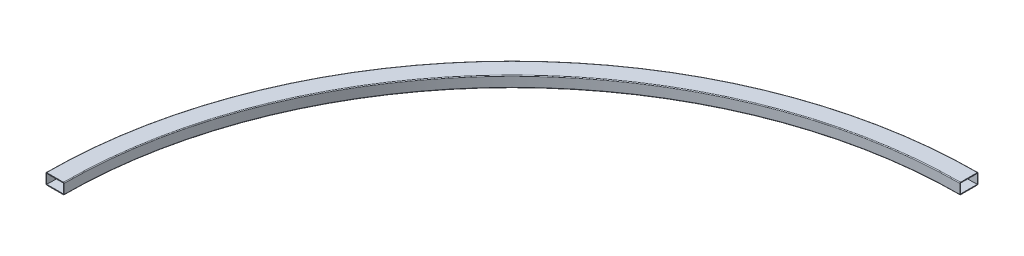
ISO-10303-21;
HEADER;
FILE_DESCRIPTION(('STEP AP214'),'2;1');
FILE_NAME('part.step','',(''),(''),'','','');
FILE_SCHEMA(('AUTOMOTIVE_DESIGN { 1 0 10303 214 1 1 1 1 }'));
ENDSEC;
DATA;
#1=APPLICATION_CONTEXT('core data for automotive mechanical design processes');
#2=APPLICATION_PROTOCOL_DEFINITION('international standard','automotive_design',2000,#1);
#3=PRODUCT_CONTEXT('',#1,'mechanical');
#4=PRODUCT('Part','Part','',(#3));
#5=PRODUCT_RELATED_PRODUCT_CATEGORY('part','',(#4));
#6=PRODUCT_DEFINITION_FORMATION('','',#4);
#7=PRODUCT_DEFINITION_CONTEXT('part definition',#1,'design');
#8=PRODUCT_DEFINITION('design','',#6,#7);
#9=PRODUCT_DEFINITION_SHAPE('','',#8);
#10=(LENGTH_UNIT() NAMED_UNIT(*) SI_UNIT(.MILLI.,.METRE.));
#11=(NAMED_UNIT(*) PLANE_ANGLE_UNIT() SI_UNIT($,.RADIAN.));
#12=(NAMED_UNIT(*) SI_UNIT($,.STERADIAN.) SOLID_ANGLE_UNIT());
#13=UNCERTAINTY_MEASURE_WITH_UNIT(LENGTH_MEASURE(1.E-05),#10,'distance_accuracy_value','');
#14=(GEOMETRIC_REPRESENTATION_CONTEXT(3) GLOBAL_UNCERTAINTY_ASSIGNED_CONTEXT((#13)) GLOBAL_UNIT_ASSIGNED_CONTEXT((#10,
#11,#12)) REPRESENTATION_CONTEXT('',''));
#15=CARTESIAN_POINT('',(0.,0.,0.));
#16=DIRECTION('',(0.,0.,1.));
#17=DIRECTION('',(1.,0.,0.));
#18=AXIS2_PLACEMENT_3D('',#15,#16,#17);
#19=CARTESIAN_POINT('',(0.,-6.5,0.));
#20=DIRECTION('',(0.,1.,0.));
#21=DIRECTION('',(0.,0.,1.));
#22=AXIS2_PLACEMENT_3D('',#19,#20,#21);
#23=TOROIDAL_SURFACE('',#22,642.,1.00000000000011);
#24=CARTESIAN_POINT('',(0.,-7.5,0.));
#25=DIRECTION('',(0.,1.,0.));
#26=DIRECTION('',(0.,0.,1.));
#27=AXIS2_PLACEMENT_3D('',#24,#25,#26);
#28=CIRCLE('',#27,642.);
#29=CARTESIAN_POINT('',(2.24153101953729E-12,-7.5,-642.));
#30=VERTEX_POINT('',#29);
#31=CARTESIAN_POINT('',(-642.,-7.5,0.));
#32=VERTEX_POINT('',#31);
#33=EDGE_CURVE('E11',#30,#32,#28,.T.);
#34=ORIENTED_EDGE('',*,*,#33,.T.);
#35=CARTESIAN_POINT('',(-642.,-6.5,0.));
#36=DIRECTION('',(0.,0.,1.));
#37=DIRECTION('',(-1.,0.,0.));
#38=AXIS2_PLACEMENT_3D('',#35,#36,#37);
#39=CIRCLE('',#38,1.00000000000011);
#40=CARTESIAN_POINT('',(-643.,-6.5,0.));
#41=VERTEX_POINT('',#40);
#42=EDGE_CURVE('E111',#41,#32,#39,.T.);
#43=ORIENTED_EDGE('',*,*,#42,.F.);
#44=CARTESIAN_POINT('',(0.,-6.5,0.));
#45=DIRECTION('',(0.,1.,0.));
#46=DIRECTION('',(0.,0.,1.));
#47=AXIS2_PLACEMENT_3D('',#44,#45,#46);
#48=CIRCLE('',#47,643.);
#49=CARTESIAN_POINT('',(2.24502250087614E-12,-6.5,-643.));
#50=VERTEX_POINT('',#49);
#51=EDGE_CURVE('E188',#50,#41,#48,.T.);
#52=ORIENTED_EDGE('',*,*,#51,.F.);
#53=CARTESIAN_POINT('',(2.24153101953729E-12,-6.5,-642.));
#54=DIRECTION('',(-1.,0.,0.));
#55=DIRECTION('',(0.,0.,-1.));
#56=AXIS2_PLACEMENT_3D('',#53,#54,#55);
#57=CIRCLE('',#56,1.00000000000011);
#58=EDGE_CURVE('E164',#50,#30,#57,.T.);
#59=ORIENTED_EDGE('',*,*,#58,.T.);
#60=EDGE_LOOP('',(#34,#43,#52,#59));
#61=FACE_BOUND('',#60,.T.);
#62=ADVANCED_FACE('F16',(#61),#23,.T.);
#63=CARTESIAN_POINT('',(2.24153101953729E-12,-7.5,-642.));
#64=DIRECTION('',(0.,-1.,0.));
#65=DIRECTION('',(0.,0.,-1.));
#66=AXIS2_PLACEMENT_3D('',#63,#64,#65);
#67=PLANE('',#66);
#68=CARTESIAN_POINT('',(0.,-7.5,0.));
#69=DIRECTION('',(0.,1.,0.));
#70=DIRECTION('',(0.,0.,1.));
#71=AXIS2_PLACEMENT_3D('',#68,#69,#70);
#72=CIRCLE('',#71,619.);
#73=CARTESIAN_POINT('',(2.1612269487439E-12,-7.5,-619.));
#74=VERTEX_POINT('',#73);
#75=CARTESIAN_POINT('',(-619.,-7.5,0.));
#76=VERTEX_POINT('',#75);
#77=EDGE_CURVE('E24',#74,#76,#72,.T.);
#78=ORIENTED_EDGE('',*,*,#77,.T.);
#79=DIRECTION('',(1.,0.,0.));
#80=VECTOR('',#79,1.);
#81=CARTESIAN_POINT('',(-642.,-7.5,0.));
#82=LINE('',#81,#80);
#83=EDGE_CURVE('E143',#32,#76,#82,.T.);
#84=ORIENTED_EDGE('',*,*,#83,.F.);
#85=ORIENTED_EDGE('',*,*,#33,.F.);
#86=DIRECTION('',(0.,0.,1.));
#87=VECTOR('',#86,1.);
#88=CARTESIAN_POINT('',(2.24153101953729E-12,-7.5,-642.));
#89=LINE('',#88,#87);
#90=EDGE_CURVE('E167',#30,#74,#89,.T.);
#91=ORIENTED_EDGE('',*,*,#90,.T.);
#92=EDGE_LOOP('',(#78,#84,#85,#91));
#93=FACE_BOUND('',#92,.T.);
#94=ADVANCED_FACE('F18',(#93),#67,.T.);
#95=CARTESIAN_POINT('',(0.,-6.5,0.));
#96=DIRECTION('',(0.,1.,0.));
#97=DIRECTION('',(0.,0.,1.));
#98=AXIS2_PLACEMENT_3D('',#95,#96,#97);
#99=TOROIDAL_SURFACE('',#98,619.,1.);
#100=CARTESIAN_POINT('',(0.,-6.5,0.));
#101=DIRECTION('',(0.,1.,0.));
#102=DIRECTION('',(0.,0.,1.));
#103=AXIS2_PLACEMENT_3D('',#100,#101,#102);
#104=CIRCLE('',#103,618.);
#105=CARTESIAN_POINT('',(2.15773546740506E-12,-6.5,-618.));
#106=VERTEX_POINT('',#105);
#107=CARTESIAN_POINT('',(-618.,-6.5,0.));
#108=VERTEX_POINT('',#107);
#109=EDGE_CURVE('E198',#106,#108,#104,.T.);
#110=ORIENTED_EDGE('',*,*,#109,.T.);
#111=CARTESIAN_POINT('',(-619.,-6.5,0.));
#112=DIRECTION('',(0.,0.,1.));
#113=DIRECTION('',(1.,0.,0.));
#114=AXIS2_PLACEMENT_3D('',#111,#112,#113);
#115=CIRCLE('',#114,1.);
#116=EDGE_CURVE('E146',#76,#108,#115,.T.);
#117=ORIENTED_EDGE('',*,*,#116,.F.);
#118=ORIENTED_EDGE('',*,*,#77,.F.);
#119=CARTESIAN_POINT('',(2.1612269487439E-12,-6.5,-619.));
#120=DIRECTION('',(-1.,0.,0.));
#121=DIRECTION('',(0.,0.,1.));
#122=AXIS2_PLACEMENT_3D('',#119,#120,#121);
#123=CIRCLE('',#122,1.);
#124=EDGE_CURVE('E170',#74,#106,#123,.T.);
#125=ORIENTED_EDGE('',*,*,#124,.T.);
#126=EDGE_LOOP('',(#110,#117,#118,#125));
#127=FACE_BOUND('',#126,.T.);
#128=ADVANCED_FACE('F207',(#127),#99,.T.);
#129=CARTESIAN_POINT('',(0.,0.,0.));
#130=DIRECTION('',(0.,1.,0.));
#131=DIRECTION('',(0.,0.,1.));
#132=AXIS2_PLACEMENT_3D('',#129,#130,#131);
#133=CYLINDRICAL_SURFACE('',#132,618.);
#134=CARTESIAN_POINT('',(0.,6.5,0.));
#135=DIRECTION('',(0.,1.,0.));
#136=DIRECTION('',(0.,0.,1.));
#137=AXIS2_PLACEMENT_3D('',#134,#135,#136);
#138=CIRCLE('',#137,618.);
#139=CARTESIAN_POINT('',(2.15773546740506E-12,6.5,-618.));
#140=VERTEX_POINT('',#139);
#141=CARTESIAN_POINT('',(-618.,6.5,0.));
#142=VERTEX_POINT('',#141);
#143=EDGE_CURVE('E196',#140,#142,#138,.T.);
#144=ORIENTED_EDGE('',*,*,#143,.T.);
#145=DIRECTION('',(0.,1.,0.));
#146=VECTOR('',#145,1.);
#147=CARTESIAN_POINT('',(-618.,-6.5,0.));
#148=LINE('',#147,#146);
#149=EDGE_CURVE('E149',#108,#142,#148,.T.);
#150=ORIENTED_EDGE('',*,*,#149,.F.);
#151=ORIENTED_EDGE('',*,*,#109,.F.);
#152=DIRECTION('',(0.,1.,0.));
#153=VECTOR('',#152,1.);
#154=CARTESIAN_POINT('',(2.15773546740506E-12,-6.5,-618.));
#155=LINE('',#154,#153);
#156=EDGE_CURVE('E173',#106,#140,#155,.T.);
#157=ORIENTED_EDGE('',*,*,#156,.T.);
#158=EDGE_LOOP('',(#144,#150,#151,#157));
#159=FACE_BOUND('',#158,.T.);
#160=ADVANCED_FACE('F210',(#159),#133,.F.);
#161=CARTESIAN_POINT('',(0.,6.5,0.));
#162=DIRECTION('',(0.,1.,0.));
#163=DIRECTION('',(0.,0.,1.));
#164=AXIS2_PLACEMENT_3D('',#161,#162,#163);
#165=TOROIDAL_SURFACE('',#164,619.,1.);
#166=CARTESIAN_POINT('',(0.,7.5,0.));
#167=DIRECTION('',(0.,1.,0.));
#168=DIRECTION('',(0.,0.,1.));
#169=AXIS2_PLACEMENT_3D('',#166,#167,#168);
#170=CIRCLE('',#169,619.);
#171=CARTESIAN_POINT('',(2.1612269487439E-12,7.5,-619.));
#172=VERTEX_POINT('',#171);
#173=CARTESIAN_POINT('',(-619.,7.5,0.));
#174=VERTEX_POINT('',#173);
#175=EDGE_CURVE('E194',#172,#174,#170,.T.);
#176=ORIENTED_EDGE('',*,*,#175,.T.);
#177=CARTESIAN_POINT('',(-619.,6.5,0.));
#178=DIRECTION('',(0.,0.,1.));
#179=DIRECTION('',(-1.,0.,0.));
#180=AXIS2_PLACEMENT_3D('',#177,#178,#179);
#181=CIRCLE('',#180,1.);
#182=EDGE_CURVE('E152',#142,#174,#181,.T.);
#183=ORIENTED_EDGE('',*,*,#182,.F.);
#184=ORIENTED_EDGE('',*,*,#143,.F.);
#185=CARTESIAN_POINT('',(2.1612269487439E-12,6.5,-619.));
#186=DIRECTION('',(-1.,0.,0.));
#187=DIRECTION('',(0.,0.,-1.));
#188=AXIS2_PLACEMENT_3D('',#185,#186,#187);
#189=CIRCLE('',#188,1.);
#190=EDGE_CURVE('E176',#140,#172,#189,.T.);
#191=ORIENTED_EDGE('',*,*,#190,.T.);
#192=EDGE_LOOP('',(#176,#183,#184,#191));
#193=FACE_BOUND('',#192,.T.);
#194=ADVANCED_FACE('F215',(#193),#165,.T.);
#195=CARTESIAN_POINT('',(2.24153101953729E-12,7.5,-642.));
#196=DIRECTION('',(0.,1.,0.));
#197=DIRECTION('',(0.,0.,1.));
#198=AXIS2_PLACEMENT_3D('',#195,#196,#197);
#199=PLANE('',#198);
#200=CARTESIAN_POINT('',(0.,7.5,0.));
#201=DIRECTION('',(0.,1.,0.));
#202=DIRECTION('',(0.,0.,1.));
#203=AXIS2_PLACEMENT_3D('',#200,#201,#202);
#204=CIRCLE('',#203,642.);
#205=CARTESIAN_POINT('',(2.24153101953729E-12,7.5,-642.));
#206=VERTEX_POINT('',#205);
#207=CARTESIAN_POINT('',(-642.,7.5,0.));
#208=VERTEX_POINT('',#207);
#209=EDGE_CURVE('E192',#206,#208,#204,.T.);
#210=ORIENTED_EDGE('',*,*,#209,.T.);
#211=DIRECTION('',(-1.,0.,0.));
#212=VECTOR('',#211,1.);
#213=CARTESIAN_POINT('',(-642.,7.5,0.));
#214=LINE('',#213,#212);
#215=EDGE_CURVE('E155',#174,#208,#214,.T.);
#216=ORIENTED_EDGE('',*,*,#215,.F.);
#217=ORIENTED_EDGE('',*,*,#175,.F.);
#218=DIRECTION('',(0.,0.,-1.));
#219=VECTOR('',#218,1.);
#220=CARTESIAN_POINT('',(2.24153101953729E-12,7.5,-642.));
#221=LINE('',#220,#219);
#222=EDGE_CURVE('E179',#172,#206,#221,.T.);
#223=ORIENTED_EDGE('',*,*,#222,.T.);
#224=EDGE_LOOP('',(#210,#216,#217,#223));
#225=FACE_BOUND('',#224,.T.);
#226=ADVANCED_FACE('F218',(#225),#199,.T.);
#227=CARTESIAN_POINT('',(0.,6.5,0.));
#228=DIRECTION('',(0.,1.,0.));
#229=DIRECTION('',(0.,0.,1.));
#230=AXIS2_PLACEMENT_3D('',#227,#228,#229);
#231=TOROIDAL_SURFACE('',#230,642.,1.00000000000011);
#232=CARTESIAN_POINT('',(0.,6.5,0.));
#233=DIRECTION('',(0.,1.,0.));
#234=DIRECTION('',(0.,0.,1.));
#235=AXIS2_PLACEMENT_3D('',#232,#233,#234);
#236=CIRCLE('',#235,643.);
#237=CARTESIAN_POINT('',(2.24502250087614E-12,6.5,-643.));
#238=VERTEX_POINT('',#237);
#239=CARTESIAN_POINT('',(-643.,6.5,0.));
#240=VERTEX_POINT('',#239);
#241=EDGE_CURVE('E190',#238,#240,#236,.T.);
#242=ORIENTED_EDGE('',*,*,#241,.T.);
#243=CARTESIAN_POINT('',(-642.,6.5,0.));
#244=DIRECTION('',(0.,0.,1.));
#245=DIRECTION('',(-1.,0.,0.));
#246=AXIS2_PLACEMENT_3D('',#243,#244,#245);
#247=CIRCLE('',#246,1.00000000000011);
#248=EDGE_CURVE('E158',#208,#240,#247,.T.);
#249=ORIENTED_EDGE('',*,*,#248,.F.);
#250=ORIENTED_EDGE('',*,*,#209,.F.);
#251=CARTESIAN_POINT('',(2.24153101953729E-12,6.5,-642.));
#252=DIRECTION('',(-1.,0.,0.));
#253=DIRECTION('',(0.,0.,-1.));
#254=AXIS2_PLACEMENT_3D('',#251,#252,#253);
#255=CIRCLE('',#254,1.00000000000011);
#256=EDGE_CURVE('E182',#206,#238,#255,.T.);
#257=ORIENTED_EDGE('',*,*,#256,.T.);
#258=EDGE_LOOP('',(#242,#249,#250,#257));
#259=FACE_BOUND('',#258,.T.);
#260=ADVANCED_FACE('F223',(#259),#231,.T.);
#261=CARTESIAN_POINT('',(0.,0.,0.));
#262=DIRECTION('',(0.,1.,0.));
#263=DIRECTION('',(0.,0.,1.));
#264=AXIS2_PLACEMENT_3D('',#261,#262,#263);
#265=CYLINDRICAL_SURFACE('',#264,643.);
#266=DIRECTION('',(0.,-1.,0.));
#267=VECTOR('',#266,1.);
#268=CARTESIAN_POINT('',(2.24502250087614E-12,-6.5,-643.));
#269=LINE('',#268,#267);
#270=EDGE_CURVE('E185',#238,#50,#269,.T.);
#271=ORIENTED_EDGE('',*,*,#270,.T.);
#272=ORIENTED_EDGE('',*,*,#51,.T.);
#273=DIRECTION('',(0.,-1.,0.));
#274=VECTOR('',#273,1.);
#275=CARTESIAN_POINT('',(-643.,-6.5,0.));
#276=LINE('',#275,#274);
#277=EDGE_CURVE('E161',#240,#41,#276,.T.);
#278=ORIENTED_EDGE('',*,*,#277,.F.);
#279=ORIENTED_EDGE('',*,*,#241,.F.);
#280=EDGE_LOOP('',(#271,#272,#278,#279));
#281=FACE_BOUND('',#280,.T.);
#282=ADVANCED_FACE('F226',(#281),#265,.T.);
#283=CARTESIAN_POINT('',(2.24153101953729E-12,-6.5,-642.));
#284=DIRECTION('',(-1.,0.,0.));
#285=DIRECTION('',(0.,0.,1.));
#286=AXIS2_PLACEMENT_3D('',#283,#284,#285);
#287=PLANE('',#286);
#288=DIRECTION('',(0.,0.,-1.));
#289=VECTOR('',#288,1.);
#290=CARTESIAN_POINT('',(2.24153101953729E-12,6.5,-642.));
#291=LINE('',#290,#289);
#292=CARTESIAN_POINT('',(2.1612269487439E-12,6.5,-619.));
#293=VERTEX_POINT('',#292);
#294=CARTESIAN_POINT('',(2.24153101953729E-12,6.5,-642.));
#295=VERTEX_POINT('',#294);
#296=EDGE_CURVE('E134',#293,#295,#291,.T.);
#297=ORIENTED_EDGE('',*,*,#296,.T.);
#298=DIRECTION('',(0.,-1.,0.));
#299=VECTOR('',#298,1.);
#300=CARTESIAN_POINT('',(2.24153101953729E-12,-6.5,-642.));
#301=LINE('',#300,#299);
#302=CARTESIAN_POINT('',(2.24153101953729E-12,-6.5,-642.));
#303=VERTEX_POINT('',#302);
#304=EDGE_CURVE('E31',#295,#303,#301,.T.);
#305=ORIENTED_EDGE('',*,*,#304,.T.);
#306=DIRECTION('',(0.,0.,1.));
#307=VECTOR('',#306,1.);
#308=CARTESIAN_POINT('',(2.24153101953729E-12,-6.5,-642.));
#309=LINE('',#308,#307);
#310=CARTESIAN_POINT('',(2.1612269487439E-12,-6.5,-619.));
#311=VERTEX_POINT('',#310);
#312=EDGE_CURVE('E110',#303,#311,#309,.T.);
#313=ORIENTED_EDGE('',*,*,#312,.T.);
#314=DIRECTION('',(0.,1.,0.));
#315=VECTOR('',#314,1.);
#316=CARTESIAN_POINT('',(2.1612269487439E-12,-6.5,-619.));
#317=LINE('',#316,#315);
#318=EDGE_CURVE('E131',#311,#293,#317,.T.);
#319=ORIENTED_EDGE('',*,*,#318,.T.);
#320=EDGE_LOOP('',(#297,#305,#313,#319));
#321=FACE_BOUND('',#320,.T.);
#322=ORIENTED_EDGE('',*,*,#58,.F.);
#323=ORIENTED_EDGE('',*,*,#270,.F.);
#324=ORIENTED_EDGE('',*,*,#256,.F.);
#325=ORIENTED_EDGE('',*,*,#222,.F.);
#326=ORIENTED_EDGE('',*,*,#190,.F.);
#327=ORIENTED_EDGE('',*,*,#156,.F.);
#328=ORIENTED_EDGE('',*,*,#124,.F.);
#329=ORIENTED_EDGE('',*,*,#90,.F.);
#330=EDGE_LOOP('',(#322,#323,#324,#325,#326,#327,#328,#329));
#331=FACE_BOUND('',#330,.T.);
#332=ADVANCED_FACE('F230',(#321,#331),#287,.F.);
#333=CARTESIAN_POINT('',(-642.,-6.5,0.));
#334=DIRECTION('',(0.,0.,1.));
#335=DIRECTION('',(1.,0.,0.));
#336=AXIS2_PLACEMENT_3D('',#333,#334,#335);
#337=PLANE('',#336);
#338=DIRECTION('',(0.,-1.,0.));
#339=VECTOR('',#338,1.);
#340=CARTESIAN_POINT('',(-642.,-6.5,0.));
#341=LINE('',#340,#339);
#342=CARTESIAN_POINT('',(-642.,6.5,0.));
#343=VERTEX_POINT('',#342);
#344=CARTESIAN_POINT('',(-642.,-6.5,0.));
#345=VERTEX_POINT('',#344);
#346=EDGE_CURVE('E115',#343,#345,#341,.T.);
#347=ORIENTED_EDGE('',*,*,#346,.F.);
#348=DIRECTION('',(-1.,0.,0.));
#349=VECTOR('',#348,1.);
#350=CARTESIAN_POINT('',(-642.,6.5,0.));
#351=LINE('',#350,#349);
#352=CARTESIAN_POINT('',(-619.,6.5,0.));
#353=VERTEX_POINT('',#352);
#354=EDGE_CURVE('E125',#353,#343,#351,.T.);
#355=ORIENTED_EDGE('',*,*,#354,.F.);
#356=DIRECTION('',(0.,1.,0.));
#357=VECTOR('',#356,1.);
#358=CARTESIAN_POINT('',(-619.,-6.5,0.));
#359=LINE('',#358,#357);
#360=CARTESIAN_POINT('',(-619.,-6.5,0.));
#361=VERTEX_POINT('',#360);
#362=EDGE_CURVE('E39',#361,#353,#359,.T.);
#363=ORIENTED_EDGE('',*,*,#362,.F.);
#364=DIRECTION('',(1.,0.,0.));
#365=VECTOR('',#364,1.);
#366=CARTESIAN_POINT('',(-642.,-6.5,0.));
#367=LINE('',#366,#365);
#368=EDGE_CURVE('E108',#345,#361,#367,.T.);
#369=ORIENTED_EDGE('',*,*,#368,.F.);
#370=EDGE_LOOP('',(#347,#355,#363,#369));
#371=FACE_BOUND('',#370,.T.);
#372=ORIENTED_EDGE('',*,*,#42,.T.);
#373=ORIENTED_EDGE('',*,*,#83,.T.);
#374=ORIENTED_EDGE('',*,*,#116,.T.);
#375=ORIENTED_EDGE('',*,*,#149,.T.);
#376=ORIENTED_EDGE('',*,*,#182,.T.);
#377=ORIENTED_EDGE('',*,*,#215,.T.);
#378=ORIENTED_EDGE('',*,*,#248,.T.);
#379=ORIENTED_EDGE('',*,*,#277,.T.);
#380=EDGE_LOOP('',(#372,#373,#374,#375,#376,#377,#378,#379));
#381=FACE_BOUND('',#380,.T.);
#382=ADVANCED_FACE('F122',(#371,#381),#337,.T.);
#383=CARTESIAN_POINT('',(0.,0.,0.));
#384=DIRECTION('',(0.,1.,0.));
#385=DIRECTION('',(0.,0.,1.));
#386=AXIS2_PLACEMENT_3D('',#383,#384,#385);
#387=CYLINDRICAL_SURFACE('',#386,642.);
#388=CARTESIAN_POINT('',(0.,-6.5,0.));
#389=DIRECTION('',(0.,1.,0.));
#390=DIRECTION('',(0.,0.,1.));
#391=AXIS2_PLACEMENT_3D('',#388,#389,#390);
#392=CIRCLE('',#391,642.);
#393=EDGE_CURVE('E104',#303,#345,#392,.T.);
#394=ORIENTED_EDGE('',*,*,#393,.F.);
#395=ORIENTED_EDGE('',*,*,#304,.F.);
#396=CARTESIAN_POINT('',(0.,6.5,0.));
#397=DIRECTION('',(0.,1.,0.));
#398=DIRECTION('',(0.,0.,1.));
#399=AXIS2_PLACEMENT_3D('',#396,#397,#398);
#400=CIRCLE('',#399,642.);
#401=EDGE_CURVE('E117',#295,#343,#400,.T.);
#402=ORIENTED_EDGE('',*,*,#401,.T.);
#403=ORIENTED_EDGE('',*,*,#346,.T.);
#404=EDGE_LOOP('',(#394,#395,#402,#403));
#405=FACE_BOUND('',#404,.T.);
#406=ADVANCED_FACE('F116',(#405),#387,.F.);
#407=CARTESIAN_POINT('',(2.24153101953729E-12,-6.5,-642.));
#408=DIRECTION('',(0.,-1.,0.));
#409=DIRECTION('',(0.,0.,-1.));
#410=AXIS2_PLACEMENT_3D('',#407,#408,#409);
#411=PLANE('',#410);
#412=CARTESIAN_POINT('',(0.,-6.5,0.));
#413=DIRECTION('',(0.,1.,0.));
#414=DIRECTION('',(0.,0.,1.));
#415=AXIS2_PLACEMENT_3D('',#412,#413,#414);
#416=CIRCLE('',#415,619.);
#417=EDGE_CURVE('E112',#311,#361,#416,.T.);
#418=ORIENTED_EDGE('',*,*,#417,.F.);
#419=ORIENTED_EDGE('',*,*,#312,.F.);
#420=ORIENTED_EDGE('',*,*,#393,.T.);
#421=ORIENTED_EDGE('',*,*,#368,.T.);
#422=EDGE_LOOP('',(#418,#419,#420,#421));
#423=FACE_BOUND('',#422,.T.);
#424=ADVANCED_FACE('F106',(#423),#411,.F.);
#425=CARTESIAN_POINT('',(0.,0.,0.));
#426=DIRECTION('',(0.,1.,0.));
#427=DIRECTION('',(0.,0.,1.));
#428=AXIS2_PLACEMENT_3D('',#425,#426,#427);
#429=CYLINDRICAL_SURFACE('',#428,619.);
#430=CARTESIAN_POINT('',(0.,6.5,0.));
#431=DIRECTION('',(0.,1.,0.));
#432=DIRECTION('',(0.,0.,1.));
#433=AXIS2_PLACEMENT_3D('',#430,#431,#432);
#434=CIRCLE('',#433,619.);
#435=EDGE_CURVE('E138',#293,#353,#434,.T.);
#436=ORIENTED_EDGE('',*,*,#435,.F.);
#437=ORIENTED_EDGE('',*,*,#318,.F.);
#438=ORIENTED_EDGE('',*,*,#417,.T.);
#439=ORIENTED_EDGE('',*,*,#362,.T.);
#440=EDGE_LOOP('',(#436,#437,#438,#439));
#441=FACE_BOUND('',#440,.T.);
#442=ADVANCED_FACE('F319',(#441),#429,.T.);
#443=CARTESIAN_POINT('',(2.24153101953729E-12,6.5,-642.));
#444=DIRECTION('',(0.,1.,0.));
#445=DIRECTION('',(0.,0.,1.));
#446=AXIS2_PLACEMENT_3D('',#443,#444,#445);
#447=PLANE('',#446);
#448=ORIENTED_EDGE('',*,*,#296,.F.);
#449=ORIENTED_EDGE('',*,*,#435,.T.);
#450=ORIENTED_EDGE('',*,*,#354,.T.);
#451=ORIENTED_EDGE('',*,*,#401,.F.);
#452=EDGE_LOOP('',(#448,#449,#450,#451));
#453=FACE_BOUND('',#452,.T.);
#454=ADVANCED_FACE('F328',(#453),#447,.F.);
#455=CLOSED_SHELL('',(#62,#94,#128,#160,#194,#226,#260,#282,#332,#382,#406,#424,#442,#454));
#456=MANIFOLD_SOLID_BREP('B1',#455);
#457=ADVANCED_BREP_SHAPE_REPRESENTATION('',(#18,#456),#14);
#458=SHAPE_DEFINITION_REPRESENTATION(#9,#457);
ENDSEC;
END-ISO-10303-21;
